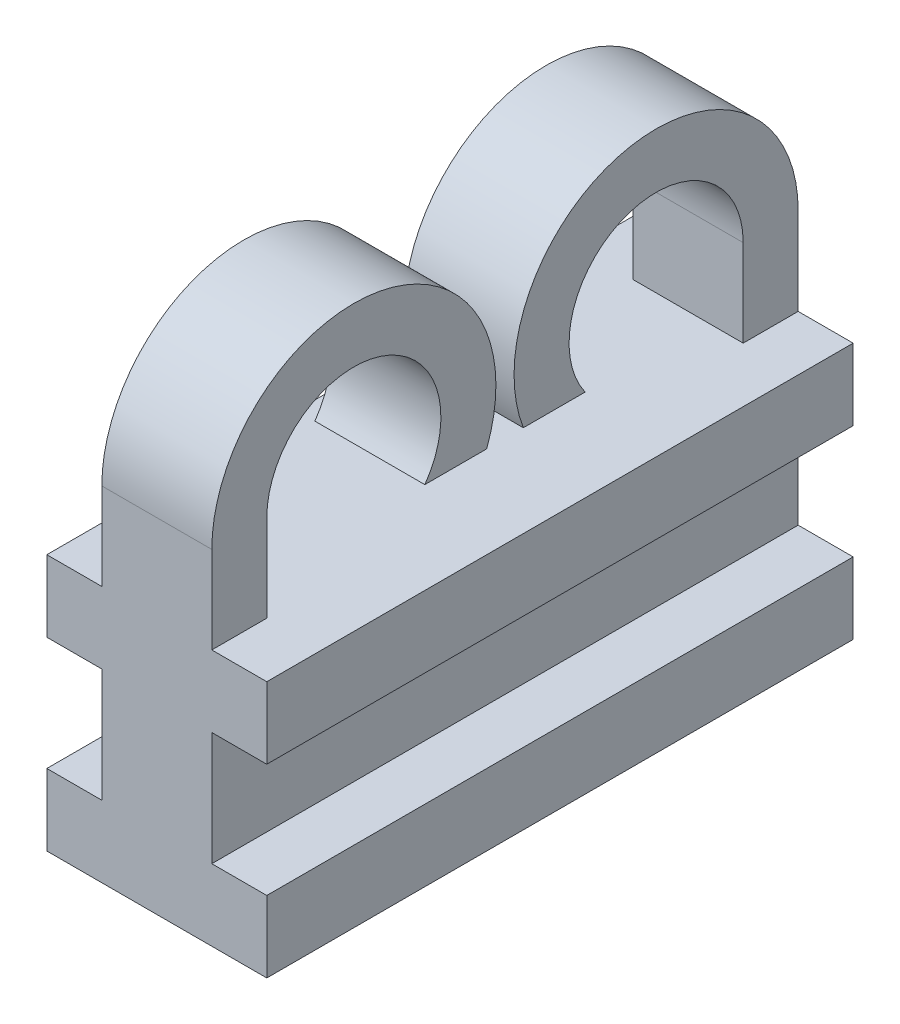
ISO-10303-21;
HEADER;
FILE_DESCRIPTION(('STEP AP214'),'2;1');
FILE_NAME('part.step','',(''),(''),'','','');
FILE_SCHEMA(('AUTOMOTIVE_DESIGN { 1 0 10303 214 1 1 1 1 }'));
ENDSEC;
DATA;
#1=APPLICATION_CONTEXT('core data for automotive mechanical design processes');
#2=APPLICATION_PROTOCOL_DEFINITION('international standard','automotive_design',2000,#1);
#3=PRODUCT_CONTEXT('',#1,'mechanical');
#4=PRODUCT('Part','Part','',(#3));
#5=PRODUCT_RELATED_PRODUCT_CATEGORY('part','',(#4));
#6=PRODUCT_DEFINITION_FORMATION('','',#4);
#7=PRODUCT_DEFINITION_CONTEXT('part definition',#1,'design');
#8=PRODUCT_DEFINITION('design','',#6,#7);
#9=PRODUCT_DEFINITION_SHAPE('','',#8);
#10=(LENGTH_UNIT() NAMED_UNIT(*) SI_UNIT(.MILLI.,.METRE.));
#11=(NAMED_UNIT(*) PLANE_ANGLE_UNIT() SI_UNIT($,.RADIAN.));
#12=(NAMED_UNIT(*) SI_UNIT($,.STERADIAN.) SOLID_ANGLE_UNIT());
#13=UNCERTAINTY_MEASURE_WITH_UNIT(LENGTH_MEASURE(1.E-05),#10,'distance_accuracy_value','');
#14=(GEOMETRIC_REPRESENTATION_CONTEXT(3) GLOBAL_UNCERTAINTY_ASSIGNED_CONTEXT((#13)) GLOBAL_UNIT_ASSIGNED_CONTEXT((#10,
#11,#12)) REPRESENTATION_CONTEXT('',''));
#15=CARTESIAN_POINT('',(0.,0.,0.));
#16=DIRECTION('',(0.,0.,1.));
#17=DIRECTION('',(1.,0.,0.));
#18=AXIS2_PLACEMENT_3D('',#15,#16,#17);
#19=CARTESIAN_POINT('',(3.,0.,0.));
#20=DIRECTION('',(1.,0.,0.));
#21=DIRECTION('',(0.,0.,-1.));
#22=AXIS2_PLACEMENT_3D('',#19,#20,#21);
#23=PLANE('',#22);
#24=DIRECTION('',(0.,-1.,0.));
#25=VECTOR('',#24,1.);
#26=CARTESIAN_POINT('',(3.,0.,7.99784418654736));
#27=LINE('',#26,#25);
#28=CARTESIAN_POINT('',(3.,-1.95,7.99784418654736));
#29=VERTEX_POINT('',#28);
#30=CARTESIAN_POINT('',(3.,-5.05,7.99784418654736));
#31=VERTEX_POINT('',#30);
#32=EDGE_CURVE('E346',#29,#31,#27,.T.);
#33=ORIENTED_EDGE('',*,*,#32,.T.);
#34=DIRECTION('',(0.,0.,-1.));
#35=VECTOR('',#34,1.);
#36=CARTESIAN_POINT('',(3.,-5.05,0.));
#37=LINE('',#36,#35);
#38=CARTESIAN_POINT('',(3.,-5.05,-7.99784418654736));
#39=VERTEX_POINT('',#38);
#40=EDGE_CURVE('E293',#31,#39,#37,.T.);
#41=ORIENTED_EDGE('',*,*,#40,.T.);
#42=DIRECTION('',(0.,-1.,0.));
#43=VECTOR('',#42,1.);
#44=CARTESIAN_POINT('',(3.,0.,-7.99784418654736));
#45=LINE('',#44,#43);
#46=CARTESIAN_POINT('',(3.,-1.95,-7.99784418654736));
#47=VERTEX_POINT('',#46);
#48=EDGE_CURVE('E290',#47,#39,#45,.T.);
#49=ORIENTED_EDGE('',*,*,#48,.F.);
#50=DIRECTION('',(0.,0.,1.));
#51=VECTOR('',#50,1.);
#52=CARTESIAN_POINT('',(3.,-1.95,0.));
#53=LINE('',#52,#51);
#54=EDGE_CURVE('E333',#47,#29,#53,.T.);
#55=ORIENTED_EDGE('',*,*,#54,.T.);
#56=EDGE_LOOP('',(#33,#41,#49,#55));
#57=FACE_BOUND('',#56,.T.);
#58=ADVANCED_FACE('F106',(#57),#23,.T.);
#59=CARTESIAN_POINT('',(0.,0.,0.));
#60=DIRECTION('',(1.,0.,0.));
#61=DIRECTION('',(0.,0.,-1.));
#62=AXIS2_PLACEMENT_3D('',#59,#60,#61);
#63=PLANE('',#62);
#64=DIRECTION('',(0.,0.,-1.));
#65=VECTOR('',#64,1.);
#66=CARTESIAN_POINT('',(0.,-5.05,0.));
#67=LINE('',#66,#65);
#68=CARTESIAN_POINT('',(0.,-5.05,7.99784418654736));
#69=VERTEX_POINT('',#68);
#70=CARTESIAN_POINT('',(0.,-5.05,-7.99784418654736));
#71=VERTEX_POINT('',#70);
#72=EDGE_CURVE('E121',#69,#71,#67,.T.);
#73=ORIENTED_EDGE('',*,*,#72,.F.);
#74=DIRECTION('',(0.,-1.,0.));
#75=VECTOR('',#74,1.);
#76=CARTESIAN_POINT('',(0.,0.,7.99784418654736));
#77=LINE('',#76,#75);
#78=CARTESIAN_POINT('',(0.,-1.95,7.99784418654736));
#79=VERTEX_POINT('',#78);
#80=EDGE_CURVE('E373',#79,#69,#77,.T.);
#81=ORIENTED_EDGE('',*,*,#80,.F.);
#82=DIRECTION('',(0.,0.,1.));
#83=VECTOR('',#82,1.);
#84=CARTESIAN_POINT('',(0.,-1.95,0.));
#85=LINE('',#84,#83);
#86=CARTESIAN_POINT('',(0.,-1.95,-7.99784418654736));
#87=VERTEX_POINT('',#86);
#88=EDGE_CURVE('E418',#87,#79,#85,.T.);
#89=ORIENTED_EDGE('',*,*,#88,.F.);
#90=DIRECTION('',(0.,-1.,0.));
#91=VECTOR('',#90,1.);
#92=CARTESIAN_POINT('',(0.,0.,-7.99784418654736));
#93=LINE('',#92,#91);
#94=EDGE_CURVE('E126',#87,#71,#93,.T.);
#95=ORIENTED_EDGE('',*,*,#94,.T.);
#96=EDGE_LOOP('',(#73,#81,#89,#95));
#97=FACE_BOUND('',#96,.T.);
#98=ADVANCED_FACE('F498',(#97),#63,.F.);
#99=CARTESIAN_POINT('',(3.,2.375,7.99784418654736));
#100=VERTEX_POINT('',#99);
#101=CARTESIAN_POINT('',(3.,0.,7.99784418654736));
#102=VERTEX_POINT('',#101);
#103=EDGE_CURVE('E347',#100,#102,#27,.T.);
#104=ORIENTED_EDGE('',*,*,#103,.T.);
#105=DIRECTION('',(0.,0.,-1.));
#106=VECTOR('',#105,1.);
#107=CARTESIAN_POINT('',(3.,0.,0.));
#108=LINE('',#107,#106);
#109=CARTESIAN_POINT('',(3.,0.,6.49784418654736));
#110=VERTEX_POINT('',#109);
#111=EDGE_CURVE('E339',#102,#110,#108,.T.);
#112=ORIENTED_EDGE('',*,*,#111,.T.);
#113=DIRECTION('',(0.,1.,0.));
#114=VECTOR('',#113,1.);
#115=CARTESIAN_POINT('',(3.,0.,6.49784418654736));
#116=LINE('',#115,#114);
#117=CARTESIAN_POINT('',(3.,2.375,6.49784418654736));
#118=VERTEX_POINT('',#117);
#119=EDGE_CURVE('E362',#110,#118,#116,.T.);
#120=ORIENTED_EDGE('',*,*,#119,.T.);
#121=CARTESIAN_POINT('',(3.,2.375,4.12284418654736));
#122=DIRECTION('',(1.,0.,0.));
#123=DIRECTION('',(0.,0.,-1.));
#124=AXIS2_PLACEMENT_3D('',#121,#122,#123);
#125=CIRCLE('',#124,2.375);
#126=CARTESIAN_POINT('',(3.,1.,2.18635251344365));
#127=VERTEX_POINT('',#126);
#128=EDGE_CURVE('E364',#118,#127,#125,.F.);
#129=ORIENTED_EDGE('',*,*,#128,.T.);
#130=DIRECTION('',(0.,0.,-1.));
#131=VECTOR('',#130,1.);
#132=CARTESIAN_POINT('',(3.,1.,0.));
#133=LINE('',#132,#131);
#134=CARTESIAN_POINT('',(3.,1.,0.499999999999999));
#135=VERTEX_POINT('',#134);
#136=EDGE_CURVE('E340',#127,#135,#133,.T.);
#137=ORIENTED_EDGE('',*,*,#136,.T.);
#138=CARTESIAN_POINT('',(3.,2.375,4.12284418654736));
#139=DIRECTION('',(1.,0.,0.));
#140=DIRECTION('',(0.,0.,-1.));
#141=AXIS2_PLACEMENT_3D('',#138,#139,#140);
#142=CIRCLE('',#141,3.875);
#143=EDGE_CURVE('E343',#135,#100,#142,.T.);
#144=ORIENTED_EDGE('',*,*,#143,.T.);
#145=EDGE_LOOP('',(#104,#112,#120,#129,#137,#144));
#146=FACE_BOUND('',#145,.T.);
#147=ADVANCED_FACE('F461',(#146),#23,.T.);
#148=DIRECTION('',(0.,-1.,0.));
#149=VECTOR('',#148,1.);
#150=CARTESIAN_POINT('',(3.,0.,-6.49784418654736));
#151=LINE('',#150,#149);
#152=CARTESIAN_POINT('',(3.,2.375,-6.49784418654736));
#153=VERTEX_POINT('',#152);
#154=CARTESIAN_POINT('',(3.,0.,-6.49784418654736));
#155=VERTEX_POINT('',#154);
#156=EDGE_CURVE('E359',#153,#155,#151,.T.);
#157=ORIENTED_EDGE('',*,*,#156,.T.);
#158=CARTESIAN_POINT('',(3.,0.,-7.99784418654736));
#159=VERTEX_POINT('',#158);
#160=EDGE_CURVE('E336',#155,#159,#108,.T.);
#161=ORIENTED_EDGE('',*,*,#160,.T.);
#162=CARTESIAN_POINT('',(3.,2.375,-7.99784418654736));
#163=VERTEX_POINT('',#162);
#164=EDGE_CURVE('E350',#163,#159,#45,.T.);
#165=ORIENTED_EDGE('',*,*,#164,.F.);
#166=CARTESIAN_POINT('',(3.,2.375,-4.12284418654736));
#167=DIRECTION('',(1.,0.,0.));
#168=DIRECTION('',(0.,0.,-1.));
#169=AXIS2_PLACEMENT_3D('',#166,#167,#168);
#170=CIRCLE('',#169,3.875);
#171=CARTESIAN_POINT('',(3.,1.,-0.500000000000001));
#172=VERTEX_POINT('',#171);
#173=EDGE_CURVE('E353',#163,#172,#170,.T.);
#174=ORIENTED_EDGE('',*,*,#173,.T.);
#175=DIRECTION('',(0.,0.,-1.));
#176=VECTOR('',#175,1.);
#177=CARTESIAN_POINT('',(3.,1.,0.));
#178=LINE('',#177,#176);
#179=CARTESIAN_POINT('',(3.,1.,-2.18635251344365));
#180=VERTEX_POINT('',#179);
#181=EDGE_CURVE('E355',#172,#180,#178,.T.);
#182=ORIENTED_EDGE('',*,*,#181,.T.);
#183=CARTESIAN_POINT('',(3.,2.375,-4.12284418654736));
#184=DIRECTION('',(1.,0.,0.));
#185=DIRECTION('',(0.,0.,-1.));
#186=AXIS2_PLACEMENT_3D('',#183,#184,#185);
#187=CIRCLE('',#186,2.375);
#188=EDGE_CURVE('E357',#180,#153,#187,.F.);
#189=ORIENTED_EDGE('',*,*,#188,.T.);
#190=EDGE_LOOP('',(#157,#161,#165,#174,#182,#189));
#191=FACE_BOUND('',#190,.T.);
#192=ADVANCED_FACE('F475',(#191),#23,.T.);
#193=DIRECTION('',(0.,0.,-1.));
#194=VECTOR('',#193,1.);
#195=CARTESIAN_POINT('',(0.,0.,0.));
#196=LINE('',#195,#194);
#197=CARTESIAN_POINT('',(0.,0.,7.99784418654736));
#198=VERTEX_POINT('',#197);
#199=CARTESIAN_POINT('',(0.,0.,6.49784418654736));
#200=VERTEX_POINT('',#199);
#201=EDGE_CURVE('E12',#198,#200,#196,.T.);
#202=ORIENTED_EDGE('',*,*,#201,.F.);
#203=CARTESIAN_POINT('',(0.,2.375,7.99784418654736));
#204=VERTEX_POINT('',#203);
#205=EDGE_CURVE('E374',#204,#198,#77,.T.);
#206=ORIENTED_EDGE('',*,*,#205,.F.);
#207=CARTESIAN_POINT('',(0.,2.375,4.12284418654736));
#208=DIRECTION('',(1.,0.,0.));
#209=DIRECTION('',(0.,0.,-1.));
#210=AXIS2_PLACEMENT_3D('',#207,#208,#209);
#211=CIRCLE('',#210,3.875);
#212=CARTESIAN_POINT('',(0.,1.,0.499999999999999));
#213=VERTEX_POINT('',#212);
#214=EDGE_CURVE('E370',#213,#204,#211,.T.);
#215=ORIENTED_EDGE('',*,*,#214,.F.);
#216=DIRECTION('',(0.,0.,-1.));
#217=VECTOR('',#216,1.);
#218=CARTESIAN_POINT('',(0.,1.,0.));
#219=LINE('',#218,#217);
#220=CARTESIAN_POINT('',(0.,1.,2.18635251344365));
#221=VERTEX_POINT('',#220);
#222=EDGE_CURVE('E367',#221,#213,#219,.T.);
#223=ORIENTED_EDGE('',*,*,#222,.F.);
#224=CARTESIAN_POINT('',(0.,2.375,4.12284418654736));
#225=DIRECTION('',(1.,0.,0.));
#226=DIRECTION('',(0.,0.,-1.));
#227=AXIS2_PLACEMENT_3D('',#224,#225,#226);
#228=CIRCLE('',#227,2.375);
#229=CARTESIAN_POINT('',(0.,2.375,6.49784418654736));
#230=VERTEX_POINT('',#229);
#231=EDGE_CURVE('E344',#230,#221,#228,.F.);
#232=ORIENTED_EDGE('',*,*,#231,.F.);
#233=DIRECTION('',(0.,1.,0.));
#234=VECTOR('',#233,1.);
#235=CARTESIAN_POINT('',(0.,0.,6.49784418654736));
#236=LINE('',#235,#234);
#237=EDGE_CURVE('E388',#200,#230,#236,.T.);
#238=ORIENTED_EDGE('',*,*,#237,.F.);
#239=EDGE_LOOP('',(#202,#206,#215,#223,#232,#238));
#240=FACE_BOUND('',#239,.T.);
#241=ADVANCED_FACE('F447',(#240),#63,.F.);
#242=CARTESIAN_POINT('',(0.,0.,-6.49784418654736));
#243=VERTEX_POINT('',#242);
#244=CARTESIAN_POINT('',(0.,0.,-7.99784418654736));
#245=VERTEX_POINT('',#244);
#246=EDGE_CURVE('E110',#243,#245,#196,.T.);
#247=ORIENTED_EDGE('',*,*,#246,.F.);
#248=DIRECTION('',(0.,-1.,0.));
#249=VECTOR('',#248,1.);
#250=CARTESIAN_POINT('',(0.,0.,-6.49784418654736));
#251=LINE('',#250,#249);
#252=CARTESIAN_POINT('',(0.,2.375,-6.49784418654736));
#253=VERTEX_POINT('',#252);
#254=EDGE_CURVE('E385',#253,#243,#251,.T.);
#255=ORIENTED_EDGE('',*,*,#254,.F.);
#256=CARTESIAN_POINT('',(0.,2.375,-4.12284418654736));
#257=DIRECTION('',(1.,0.,0.));
#258=DIRECTION('',(0.,0.,-1.));
#259=AXIS2_PLACEMENT_3D('',#256,#257,#258);
#260=CIRCLE('',#259,2.375);
#261=CARTESIAN_POINT('',(0.,1.,-2.18635251344365));
#262=VERTEX_POINT('',#261);
#263=EDGE_CURVE('E383',#262,#253,#260,.F.);
#264=ORIENTED_EDGE('',*,*,#263,.F.);
#265=DIRECTION('',(0.,0.,-1.));
#266=VECTOR('',#265,1.);
#267=CARTESIAN_POINT('',(0.,1.,0.));
#268=LINE('',#267,#266);
#269=CARTESIAN_POINT('',(0.,1.,-0.500000000000001));
#270=VERTEX_POINT('',#269);
#271=EDGE_CURVE('E381',#270,#262,#268,.T.);
#272=ORIENTED_EDGE('',*,*,#271,.F.);
#273=CARTESIAN_POINT('',(0.,2.375,-4.12284418654736));
#274=DIRECTION('',(1.,0.,0.));
#275=DIRECTION('',(0.,0.,-1.));
#276=AXIS2_PLACEMENT_3D('',#273,#274,#275);
#277=CIRCLE('',#276,3.875);
#278=CARTESIAN_POINT('',(0.,2.375,-7.99784418654736));
#279=VERTEX_POINT('',#278);
#280=EDGE_CURVE('E379',#279,#270,#277,.T.);
#281=ORIENTED_EDGE('',*,*,#280,.F.);
#282=EDGE_CURVE('E377',#279,#245,#93,.T.);
#283=ORIENTED_EDGE('',*,*,#282,.T.);
#284=EDGE_LOOP('',(#247,#255,#264,#272,#281,#283));
#285=FACE_BOUND('',#284,.T.);
#286=ADVANCED_FACE('F494',(#285),#63,.F.);
#287=CARTESIAN_POINT('',(3.,1.,0.));
#288=DIRECTION('',(0.,1.,0.));
#289=DIRECTION('',(0.,0.,1.));
#290=AXIS2_PLACEMENT_3D('',#287,#288,#289);
#291=PLANE('',#290);
#292=ORIENTED_EDGE('',*,*,#222,.T.);
#293=DIRECTION('',(-1.,0.,0.));
#294=VECTOR('',#293,1.);
#295=CARTESIAN_POINT('',(3.,1.,0.499999999999999));
#296=LINE('',#295,#294);
#297=EDGE_CURVE('E415',#135,#213,#296,.T.);
#298=ORIENTED_EDGE('',*,*,#297,.F.);
#299=ORIENTED_EDGE('',*,*,#136,.F.);
#300=DIRECTION('',(-1.,0.,0.));
#301=VECTOR('',#300,1.);
#302=CARTESIAN_POINT('',(3.,1.,2.18635251344365));
#303=LINE('',#302,#301);
#304=EDGE_CURVE('E366',#127,#221,#303,.T.);
#305=ORIENTED_EDGE('',*,*,#304,.T.);
#306=EDGE_LOOP('',(#292,#298,#299,#305));
#307=FACE_BOUND('',#306,.T.);
#308=ADVANCED_FACE('F496',(#307),#291,.F.);
#309=CARTESIAN_POINT('',(3.,2.375,4.12284418654736));
#310=DIRECTION('',(-1.,0.,0.));
#311=DIRECTION('',(0.,0.,1.));
#312=AXIS2_PLACEMENT_3D('',#309,#310,#311);
#313=CYLINDRICAL_SURFACE('',#312,3.875);
#314=ORIENTED_EDGE('',*,*,#214,.T.);
#315=DIRECTION('',(-1.,0.,0.));
#316=VECTOR('',#315,1.);
#317=CARTESIAN_POINT('',(3.,2.375,7.99784418654736));
#318=LINE('',#317,#316);
#319=EDGE_CURVE('E412',#100,#204,#318,.T.);
#320=ORIENTED_EDGE('',*,*,#319,.F.);
#321=ORIENTED_EDGE('',*,*,#143,.F.);
#322=ORIENTED_EDGE('',*,*,#297,.T.);
#323=EDGE_LOOP('',(#314,#320,#321,#322));
#324=FACE_BOUND('',#323,.T.);
#325=ADVANCED_FACE('F503',(#324),#313,.T.);
#326=CARTESIAN_POINT('',(3.,0.,7.99784418654736));
#327=DIRECTION('',(0.,0.,-1.));
#328=DIRECTION('',(-1.,0.,0.));
#329=AXIS2_PLACEMENT_3D('',#326,#327,#328);
#330=PLANE('',#329);
#331=DIRECTION('',(-1.,0.,0.));
#332=VECTOR('',#331,1.);
#333=CARTESIAN_POINT('',(3.,-7.,7.99784418654736));
#334=LINE('',#333,#332);
#335=CARTESIAN_POINT('',(4.5,-7.,7.99784418654736));
#336=VERTEX_POINT('',#335);
#337=CARTESIAN_POINT('',(-1.5,-7.,7.99784418654736));
#338=VERTEX_POINT('',#337);
#339=EDGE_CURVE('E420',#336,#338,#334,.T.);
#340=ORIENTED_EDGE('',*,*,#339,.F.);
#341=DIRECTION('',(0.,-1.,0.));
#342=VECTOR('',#341,1.);
#343=CARTESIAN_POINT('',(4.5,-7.,7.99784418654736));
#344=LINE('',#343,#342);
#345=CARTESIAN_POINT('',(4.5,-5.05,7.99784418654736));
#346=VERTEX_POINT('',#345);
#347=EDGE_CURVE('E275',#346,#336,#344,.T.);
#348=ORIENTED_EDGE('',*,*,#347,.F.);
#349=DIRECTION('',(-1.,0.,0.));
#350=VECTOR('',#349,1.);
#351=CARTESIAN_POINT('',(4.5,-5.05,7.99784418654736));
#352=LINE('',#351,#350);
#353=EDGE_CURVE('E271',#346,#31,#352,.T.);
#354=ORIENTED_EDGE('',*,*,#353,.T.);
#355=ORIENTED_EDGE('',*,*,#32,.F.);
#356=DIRECTION('',(-1.,0.,0.));
#357=VECTOR('',#356,1.);
#358=CARTESIAN_POINT('',(4.5,-1.95,7.99784418654736));
#359=LINE('',#358,#357);
#360=CARTESIAN_POINT('',(4.5,-1.95,7.99784418654736));
#361=VERTEX_POINT('',#360);
#362=EDGE_CURVE('E324',#361,#29,#359,.T.);
#363=ORIENTED_EDGE('',*,*,#362,.F.);
#364=DIRECTION('',(0.,-1.,0.));
#365=VECTOR('',#364,1.);
#366=CARTESIAN_POINT('',(4.5,0.,7.99784418654736));
#367=LINE('',#366,#365);
#368=CARTESIAN_POINT('',(4.5,0.,7.99784418654736));
#369=VERTEX_POINT('',#368);
#370=EDGE_CURVE('E306',#369,#361,#367,.T.);
#371=ORIENTED_EDGE('',*,*,#370,.F.);
#372=DIRECTION('',(-1.,0.,0.));
#373=VECTOR('',#372,1.);
#374=CARTESIAN_POINT('',(4.5,0.,7.99784418654736));
#375=LINE('',#374,#373);
#376=EDGE_CURVE('E327',#369,#102,#375,.T.);
#377=ORIENTED_EDGE('',*,*,#376,.T.);
#378=ORIENTED_EDGE('',*,*,#103,.F.);
#379=ORIENTED_EDGE('',*,*,#319,.T.);
#380=ORIENTED_EDGE('',*,*,#205,.T.);
#381=CARTESIAN_POINT('',(-1.5,0.,7.99784418654736));
#382=VERTEX_POINT('',#381);
#383=EDGE_CURVE('E326',#198,#382,#375,.T.);
#384=ORIENTED_EDGE('',*,*,#383,.T.);
#385=DIRECTION('',(0.,-1.,0.));
#386=VECTOR('',#385,1.);
#387=CARTESIAN_POINT('',(-1.5,0.,7.99784418654736));
#388=LINE('',#387,#386);
#389=CARTESIAN_POINT('',(-1.5,-1.95,7.99784418654736));
#390=VERTEX_POINT('',#389);
#391=EDGE_CURVE('E316',#382,#390,#388,.T.);
#392=ORIENTED_EDGE('',*,*,#391,.T.);
#393=EDGE_CURVE('E323',#79,#390,#359,.T.);
#394=ORIENTED_EDGE('',*,*,#393,.F.);
#395=ORIENTED_EDGE('',*,*,#80,.T.);
#396=CARTESIAN_POINT('',(-1.5,-5.05,7.99784418654736));
#397=VERTEX_POINT('',#396);
#398=EDGE_CURVE('E668',#69,#397,#352,.T.);
#399=ORIENTED_EDGE('',*,*,#398,.T.);
#400=DIRECTION('',(0.,-1.,0.));
#401=VECTOR('',#400,1.);
#402=CARTESIAN_POINT('',(-1.5,-7.,7.99784418654736));
#403=LINE('',#402,#401);
#404=EDGE_CURVE('E681',#397,#338,#403,.T.);
#405=ORIENTED_EDGE('',*,*,#404,.T.);
#406=EDGE_LOOP('',(#340,#348,#354,#355,#363,#371,#377,#378,#379,#380,#384,#392,#394,#395,#399,#405));
#407=FACE_BOUND('',#406,.T.);
#408=ADVANCED_FACE('F442',(#407),#330,.F.);
#409=CARTESIAN_POINT('',(3.,0.,-7.99784418654736));
#410=DIRECTION('',(0.,0.,-1.));
#411=DIRECTION('',(0.,1.,0.));
#412=AXIS2_PLACEMENT_3D('',#409,#410,#411);
#413=PLANE('',#412);
#414=DIRECTION('',(-1.,0.,0.));
#415=VECTOR('',#414,1.);
#416=CARTESIAN_POINT('',(3.,-7.,-7.99784418654736));
#417=LINE('',#416,#415);
#418=CARTESIAN_POINT('',(4.5,-7.,-7.99784418654736));
#419=VERTEX_POINT('',#418);
#420=CARTESIAN_POINT('',(-1.5,-7.,-7.99784418654736));
#421=VERTEX_POINT('',#420);
#422=EDGE_CURVE('E371',#419,#421,#417,.T.);
#423=ORIENTED_EDGE('',*,*,#422,.T.);
#424=DIRECTION('',(0.,1.,0.));
#425=VECTOR('',#424,1.);
#426=CARTESIAN_POINT('',(-1.5,-7.,-7.99784418654736));
#427=LINE('',#426,#425);
#428=CARTESIAN_POINT('',(-1.5,-5.05,-7.99784418654736));
#429=VERTEX_POINT('',#428);
#430=EDGE_CURVE('E677',#421,#429,#427,.T.);
#431=ORIENTED_EDGE('',*,*,#430,.T.);
#432=DIRECTION('',(-1.,0.,0.));
#433=VECTOR('',#432,1.);
#434=CARTESIAN_POINT('',(4.5,-5.05,-7.99784418654736));
#435=LINE('',#434,#433);
#436=EDGE_CURVE('E291',#71,#429,#435,.T.);
#437=ORIENTED_EDGE('',*,*,#436,.F.);
#438=ORIENTED_EDGE('',*,*,#94,.F.);
#439=DIRECTION('',(-1.,0.,0.));
#440=VECTOR('',#439,1.);
#441=CARTESIAN_POINT('',(4.5,-1.95,-7.99784418654736));
#442=LINE('',#441,#440);
#443=CARTESIAN_POINT('',(-1.5,-1.95,-7.99784418654736));
#444=VERTEX_POINT('',#443);
#445=EDGE_CURVE('E310',#87,#444,#442,.T.);
#446=ORIENTED_EDGE('',*,*,#445,.T.);
#447=DIRECTION('',(0.,1.,0.));
#448=VECTOR('',#447,1.);
#449=CARTESIAN_POINT('',(-1.5,0.,-7.99784418654736));
#450=LINE('',#449,#448);
#451=CARTESIAN_POINT('',(-1.5,0.,-7.99784418654736));
#452=VERTEX_POINT('',#451);
#453=EDGE_CURVE('E299',#444,#452,#450,.T.);
#454=ORIENTED_EDGE('',*,*,#453,.T.);
#455=DIRECTION('',(-1.,0.,0.));
#456=VECTOR('',#455,1.);
#457=CARTESIAN_POINT('',(4.5,0.,-7.99784418654736));
#458=LINE('',#457,#456);
#459=EDGE_CURVE('E330',#245,#452,#458,.T.);
#460=ORIENTED_EDGE('',*,*,#459,.F.);
#461=ORIENTED_EDGE('',*,*,#282,.F.);
#462=DIRECTION('',(-1.,0.,0.));
#463=VECTOR('',#462,1.);
#464=CARTESIAN_POINT('',(3.,2.375,-7.99784418654736));
#465=LINE('',#464,#463);
#466=EDGE_CURVE('E410',#163,#279,#465,.T.);
#467=ORIENTED_EDGE('',*,*,#466,.F.);
#468=ORIENTED_EDGE('',*,*,#164,.T.);
#469=CARTESIAN_POINT('',(4.5,0.,-7.99784418654736));
#470=VERTEX_POINT('',#469);
#471=EDGE_CURVE('E331',#470,#159,#458,.T.);
#472=ORIENTED_EDGE('',*,*,#471,.F.);
#473=DIRECTION('',(0.,1.,0.));
#474=VECTOR('',#473,1.);
#475=CARTESIAN_POINT('',(4.5,0.,-7.99784418654736));
#476=LINE('',#475,#474);
#477=CARTESIAN_POINT('',(4.5,-1.95,-7.99784418654736));
#478=VERTEX_POINT('',#477);
#479=EDGE_CURVE('E300',#478,#470,#476,.T.);
#480=ORIENTED_EDGE('',*,*,#479,.F.);
#481=EDGE_CURVE('E321',#478,#47,#442,.T.);
#482=ORIENTED_EDGE('',*,*,#481,.T.);
#483=ORIENTED_EDGE('',*,*,#48,.T.);
#484=CARTESIAN_POINT('',(4.5,-5.05,-7.99784418654736));
#485=VERTEX_POINT('',#484);
#486=EDGE_CURVE('E268',#485,#39,#435,.T.);
#487=ORIENTED_EDGE('',*,*,#486,.F.);
#488=DIRECTION('',(0.,1.,0.));
#489=VECTOR('',#488,1.);
#490=CARTESIAN_POINT('',(4.5,-7.,-7.99784418654736));
#491=LINE('',#490,#489);
#492=EDGE_CURVE('E276',#419,#485,#491,.T.);
#493=ORIENTED_EDGE('',*,*,#492,.F.);
#494=EDGE_LOOP('',(#423,#431,#437,#438,#446,#454,#460,#461,#467,#468,#472,#480,#482,#483,#487,#493));
#495=FACE_BOUND('',#494,.T.);
#496=ADVANCED_FACE('F287',(#495),#413,.T.);
#497=CARTESIAN_POINT('',(3.,2.375,-4.12284418654736));
#498=DIRECTION('',(-1.,0.,0.));
#499=DIRECTION('',(0.,0.,1.));
#500=AXIS2_PLACEMENT_3D('',#497,#498,#499);
#501=CYLINDRICAL_SURFACE('',#500,3.875);
#502=ORIENTED_EDGE('',*,*,#280,.T.);
#503=DIRECTION('',(-1.,0.,0.));
#504=VECTOR('',#503,1.);
#505=CARTESIAN_POINT('',(3.,1.,-0.500000000000001));
#506=LINE('',#505,#504);
#507=EDGE_CURVE('E407',#172,#270,#506,.T.);
#508=ORIENTED_EDGE('',*,*,#507,.F.);
#509=ORIENTED_EDGE('',*,*,#173,.F.);
#510=ORIENTED_EDGE('',*,*,#466,.T.);
#511=EDGE_LOOP('',(#502,#508,#509,#510));
#512=FACE_BOUND('',#511,.T.);
#513=ADVANCED_FACE('F481',(#512),#501,.T.);
#514=CARTESIAN_POINT('',(3.,1.,0.));
#515=DIRECTION('',(0.,1.,0.));
#516=DIRECTION('',(0.,0.,1.));
#517=AXIS2_PLACEMENT_3D('',#514,#515,#516);
#518=PLANE('',#517);
#519=ORIENTED_EDGE('',*,*,#271,.T.);
#520=DIRECTION('',(-1.,0.,0.));
#521=VECTOR('',#520,1.);
#522=CARTESIAN_POINT('',(3.,1.,-2.18635251344365));
#523=LINE('',#522,#521);
#524=EDGE_CURVE('E404',#180,#262,#523,.T.);
#525=ORIENTED_EDGE('',*,*,#524,.F.);
#526=ORIENTED_EDGE('',*,*,#181,.F.);
#527=ORIENTED_EDGE('',*,*,#507,.T.);
#528=EDGE_LOOP('',(#519,#525,#526,#527));
#529=FACE_BOUND('',#528,.T.);
#530=ADVANCED_FACE('F487',(#529),#518,.F.);
#531=CARTESIAN_POINT('',(3.,2.375,-4.12284418654736));
#532=DIRECTION('',(-1.,0.,0.));
#533=DIRECTION('',(0.,0.,1.));
#534=AXIS2_PLACEMENT_3D('',#531,#532,#533);
#535=CYLINDRICAL_SURFACE('',#534,2.375);
#536=ORIENTED_EDGE('',*,*,#263,.T.);
#537=DIRECTION('',(-1.,0.,0.));
#538=VECTOR('',#537,1.);
#539=CARTESIAN_POINT('',(3.,2.375,-6.49784418654736));
#540=LINE('',#539,#538);
#541=EDGE_CURVE('E401',#153,#253,#540,.T.);
#542=ORIENTED_EDGE('',*,*,#541,.F.);
#543=ORIENTED_EDGE('',*,*,#188,.F.);
#544=ORIENTED_EDGE('',*,*,#524,.T.);
#545=EDGE_LOOP('',(#536,#542,#543,#544));
#546=FACE_BOUND('',#545,.T.);
#547=ADVANCED_FACE('F491',(#546),#535,.F.);
#548=CARTESIAN_POINT('',(3.,0.,-6.49784418654736));
#549=DIRECTION('',(0.,0.,-1.));
#550=DIRECTION('',(0.,1.,0.));
#551=AXIS2_PLACEMENT_3D('',#548,#549,#550);
#552=PLANE('',#551);
#553=ORIENTED_EDGE('',*,*,#254,.T.);
#554=DIRECTION('',(-1.,0.,0.));
#555=VECTOR('',#554,1.);
#556=CARTESIAN_POINT('',(3.,0.,-6.49784418654736));
#557=LINE('',#556,#555);
#558=EDGE_CURVE('E398',#155,#243,#557,.T.);
#559=ORIENTED_EDGE('',*,*,#558,.F.);
#560=ORIENTED_EDGE('',*,*,#156,.F.);
#561=ORIENTED_EDGE('',*,*,#541,.T.);
#562=EDGE_LOOP('',(#553,#559,#560,#561));
#563=FACE_BOUND('',#562,.T.);
#564=ADVANCED_FACE('F493',(#563),#552,.F.);
#565=CARTESIAN_POINT('',(3.,0.,0.));
#566=DIRECTION('',(0.,1.,0.));
#567=DIRECTION('',(0.,0.,1.));
#568=AXIS2_PLACEMENT_3D('',#565,#566,#567);
#569=PLANE('',#568);
#570=ORIENTED_EDGE('',*,*,#558,.T.);
#571=ORIENTED_EDGE('',*,*,#246,.T.);
#572=ORIENTED_EDGE('',*,*,#459,.T.);
#573=DIRECTION('',(0.,0.,1.));
#574=VECTOR('',#573,1.);
#575=CARTESIAN_POINT('',(-1.5,0.,-7.99784418654736));
#576=LINE('',#575,#574);
#577=EDGE_CURVE('E313',#452,#382,#576,.T.);
#578=ORIENTED_EDGE('',*,*,#577,.T.);
#579=ORIENTED_EDGE('',*,*,#383,.F.);
#580=ORIENTED_EDGE('',*,*,#201,.T.);
#581=DIRECTION('',(-1.,0.,0.));
#582=VECTOR('',#581,1.);
#583=CARTESIAN_POINT('',(3.,0.,6.49784418654736));
#584=LINE('',#583,#582);
#585=EDGE_CURVE('E396',#110,#200,#584,.T.);
#586=ORIENTED_EDGE('',*,*,#585,.F.);
#587=ORIENTED_EDGE('',*,*,#111,.F.);
#588=ORIENTED_EDGE('',*,*,#376,.F.);
#589=DIRECTION('',(0.,0.,1.));
#590=VECTOR('',#589,1.);
#591=CARTESIAN_POINT('',(4.5,0.,-7.99784418654736));
#592=LINE('',#591,#590);
#593=EDGE_CURVE('E303',#470,#369,#592,.T.);
#594=ORIENTED_EDGE('',*,*,#593,.F.);
#595=ORIENTED_EDGE('',*,*,#471,.T.);
#596=ORIENTED_EDGE('',*,*,#160,.F.);
#597=EDGE_LOOP('',(#570,#571,#572,#578,#579,#580,#586,#587,#588,#594,#595,#596));
#598=FACE_BOUND('',#597,.T.);
#599=ADVANCED_FACE('F428',(#598),#569,.T.);
#600=CARTESIAN_POINT('',(3.,0.,6.49784418654736));
#601=DIRECTION('',(0.,0.,1.));
#602=DIRECTION('',(1.,0.,0.));
#603=AXIS2_PLACEMENT_3D('',#600,#601,#602);
#604=PLANE('',#603);
#605=ORIENTED_EDGE('',*,*,#237,.T.);
#606=DIRECTION('',(-1.,0.,0.));
#607=VECTOR('',#606,1.);
#608=CARTESIAN_POINT('',(3.,2.375,6.49784418654736));
#609=LINE('',#608,#607);
#610=EDGE_CURVE('E393',#118,#230,#609,.T.);
#611=ORIENTED_EDGE('',*,*,#610,.F.);
#612=ORIENTED_EDGE('',*,*,#119,.F.);
#613=ORIENTED_EDGE('',*,*,#585,.T.);
#614=EDGE_LOOP('',(#605,#611,#612,#613));
#615=FACE_BOUND('',#614,.T.);
#616=ADVANCED_FACE('F453',(#615),#604,.F.);
#617=CARTESIAN_POINT('',(3.,2.375,4.12284418654736));
#618=DIRECTION('',(-1.,0.,0.));
#619=DIRECTION('',(0.,0.,1.));
#620=AXIS2_PLACEMENT_3D('',#617,#618,#619);
#621=CYLINDRICAL_SURFACE('',#620,2.375);
#622=ORIENTED_EDGE('',*,*,#231,.T.);
#623=ORIENTED_EDGE('',*,*,#304,.F.);
#624=ORIENTED_EDGE('',*,*,#128,.F.);
#625=ORIENTED_EDGE('',*,*,#610,.T.);
#626=EDGE_LOOP('',(#622,#623,#624,#625));
#627=FACE_BOUND('',#626,.T.);
#628=ADVANCED_FACE('F457',(#627),#621,.F.);
#629=CARTESIAN_POINT('',(3.,-7.,-7.99784418654736));
#630=DIRECTION('',(0.,-1.,0.));
#631=DIRECTION('',(0.,0.,-1.));
#632=AXIS2_PLACEMENT_3D('',#629,#630,#631);
#633=PLANE('',#632);
#634=ORIENTED_EDGE('',*,*,#339,.T.);
#635=DIRECTION('',(0.,0.,-1.));
#636=VECTOR('',#635,1.);
#637=CARTESIAN_POINT('',(-1.5,-7.,-7.99784418654736));
#638=LINE('',#637,#636);
#639=EDGE_CURVE('E284',#338,#421,#638,.T.);
#640=ORIENTED_EDGE('',*,*,#639,.T.);
#641=ORIENTED_EDGE('',*,*,#422,.F.);
#642=DIRECTION('',(0.,0.,-1.));
#643=VECTOR('',#642,1.);
#644=CARTESIAN_POINT('',(4.5,-7.,-7.99784418654736));
#645=LINE('',#644,#643);
#646=EDGE_CURVE('E282',#336,#419,#645,.T.);
#647=ORIENTED_EDGE('',*,*,#646,.F.);
#648=EDGE_LOOP('',(#634,#640,#641,#647));
#649=FACE_BOUND('',#648,.T.);
#650=ADVANCED_FACE('F108',(#649),#633,.T.);
#651=CARTESIAN_POINT('',(-1.5,0.,0.));
#652=DIRECTION('',(-1.,0.,0.));
#653=DIRECTION('',(0.,0.,1.));
#654=AXIS2_PLACEMENT_3D('',#651,#652,#653);
#655=PLANE('',#654);
#656=ORIENTED_EDGE('',*,*,#453,.F.);
#657=DIRECTION('',(0.,0.,-1.));
#658=VECTOR('',#657,1.);
#659=CARTESIAN_POINT('',(-1.5,-1.95,-7.99784418654736));
#660=LINE('',#659,#658);
#661=EDGE_CURVE('E304',#390,#444,#660,.T.);
#662=ORIENTED_EDGE('',*,*,#661,.F.);
#663=ORIENTED_EDGE('',*,*,#391,.F.);
#664=ORIENTED_EDGE('',*,*,#577,.F.);
#665=EDGE_LOOP('',(#656,#662,#663,#664));
#666=FACE_BOUND('',#665,.T.);
#667=ADVANCED_FACE('F437',(#666),#655,.T.);
#668=CARTESIAN_POINT('',(4.5,-1.95,-7.99784418654736));
#669=DIRECTION('',(0.,1.,0.));
#670=DIRECTION('',(0.,0.,1.));
#671=AXIS2_PLACEMENT_3D('',#668,#669,#670);
#672=PLANE('',#671);
#673=ORIENTED_EDGE('',*,*,#445,.F.);
#674=ORIENTED_EDGE('',*,*,#88,.T.);
#675=ORIENTED_EDGE('',*,*,#393,.T.);
#676=ORIENTED_EDGE('',*,*,#661,.T.);
#677=EDGE_LOOP('',(#673,#674,#675,#676));
#678=FACE_BOUND('',#677,.T.);
#679=ADVANCED_FACE('F603',(#678),#672,.F.);
#680=ORIENTED_EDGE('',*,*,#54,.F.);
#681=ORIENTED_EDGE('',*,*,#481,.F.);
#682=DIRECTION('',(0.,0.,-1.));
#683=VECTOR('',#682,1.);
#684=CARTESIAN_POINT('',(4.5,-1.95,-7.99784418654736));
#685=LINE('',#684,#683);
#686=EDGE_CURVE('E308',#361,#478,#685,.T.);
#687=ORIENTED_EDGE('',*,*,#686,.F.);
#688=ORIENTED_EDGE('',*,*,#362,.T.);
#689=EDGE_LOOP('',(#680,#681,#687,#688));
#690=FACE_BOUND('',#689,.T.);
#691=ADVANCED_FACE('F612',(#690),#672,.F.);
#692=CARTESIAN_POINT('',(4.5,0.,0.));
#693=DIRECTION('',(-1.,0.,0.));
#694=DIRECTION('',(0.,0.,1.));
#695=AXIS2_PLACEMENT_3D('',#692,#693,#694);
#696=PLANE('',#695);
#697=ORIENTED_EDGE('',*,*,#479,.T.);
#698=ORIENTED_EDGE('',*,*,#593,.T.);
#699=ORIENTED_EDGE('',*,*,#370,.T.);
#700=ORIENTED_EDGE('',*,*,#686,.T.);
#701=EDGE_LOOP('',(#697,#698,#699,#700));
#702=FACE_BOUND('',#701,.T.);
#703=ADVANCED_FACE('F469',(#702),#696,.F.);
#704=CARTESIAN_POINT('',(-1.5,0.,0.));
#705=DIRECTION('',(1.,0.,0.));
#706=DIRECTION('',(0.,0.,-1.));
#707=AXIS2_PLACEMENT_3D('',#704,#705,#706);
#708=PLANE('',#707);
#709=ORIENTED_EDGE('',*,*,#430,.F.);
#710=ORIENTED_EDGE('',*,*,#639,.F.);
#711=ORIENTED_EDGE('',*,*,#404,.F.);
#712=DIRECTION('',(0.,0.,1.));
#713=VECTOR('',#712,1.);
#714=CARTESIAN_POINT('',(-1.5,-5.05,-7.99784418654736));
#715=LINE('',#714,#713);
#716=EDGE_CURVE('E671',#429,#397,#715,.T.);
#717=ORIENTED_EDGE('',*,*,#716,.F.);
#718=EDGE_LOOP('',(#709,#710,#711,#717));
#719=FACE_BOUND('',#718,.T.);
#720=ADVANCED_FACE('F628',(#719),#708,.F.);
#721=CARTESIAN_POINT('',(4.5,-5.05,-7.99784418654736));
#722=DIRECTION('',(0.,-1.,0.));
#723=DIRECTION('',(0.,0.,-1.));
#724=AXIS2_PLACEMENT_3D('',#721,#722,#723);
#725=PLANE('',#724);
#726=ORIENTED_EDGE('',*,*,#398,.F.);
#727=ORIENTED_EDGE('',*,*,#72,.T.);
#728=ORIENTED_EDGE('',*,*,#436,.T.);
#729=ORIENTED_EDGE('',*,*,#716,.T.);
#730=EDGE_LOOP('',(#726,#727,#728,#729));
#731=FACE_BOUND('',#730,.T.);
#732=ADVANCED_FACE('F637',(#731),#725,.F.);
#733=ORIENTED_EDGE('',*,*,#40,.F.);
#734=ORIENTED_EDGE('',*,*,#353,.F.);
#735=DIRECTION('',(0.,0.,1.));
#736=VECTOR('',#735,1.);
#737=CARTESIAN_POINT('',(4.5,-5.05,-7.99784418654736));
#738=LINE('',#737,#736);
#739=EDGE_CURVE('E264',#485,#346,#738,.T.);
#740=ORIENTED_EDGE('',*,*,#739,.F.);
#741=ORIENTED_EDGE('',*,*,#486,.T.);
#742=EDGE_LOOP('',(#733,#734,#740,#741));
#743=FACE_BOUND('',#742,.T.);
#744=ADVANCED_FACE('F266',(#743),#725,.F.);
#745=CARTESIAN_POINT('',(4.5,0.,0.));
#746=DIRECTION('',(1.,0.,0.));
#747=DIRECTION('',(0.,0.,-1.));
#748=AXIS2_PLACEMENT_3D('',#745,#746,#747);
#749=PLANE('',#748);
#750=ORIENTED_EDGE('',*,*,#492,.T.);
#751=ORIENTED_EDGE('',*,*,#739,.T.);
#752=ORIENTED_EDGE('',*,*,#347,.T.);
#753=ORIENTED_EDGE('',*,*,#646,.T.);
#754=EDGE_LOOP('',(#750,#751,#752,#753));
#755=FACE_BOUND('',#754,.T.);
#756=ADVANCED_FACE('F280',(#755),#749,.T.);
#757=CLOSED_SHELL('',(#58,#98,#147,#192,#241,#286,#308,#325,#408,#496,#513,#530,#547,#564,#599,
#616,#628,#650,#667,#679,#691,#703,#720,#732,#744,#756));
#758=MANIFOLD_SOLID_BREP('B2',#757);
#759=ADVANCED_BREP_SHAPE_REPRESENTATION('',(#18,#758),#14);
#760=SHAPE_DEFINITION_REPRESENTATION(#9,#759);
ENDSEC;
END-ISO-10303-21;
